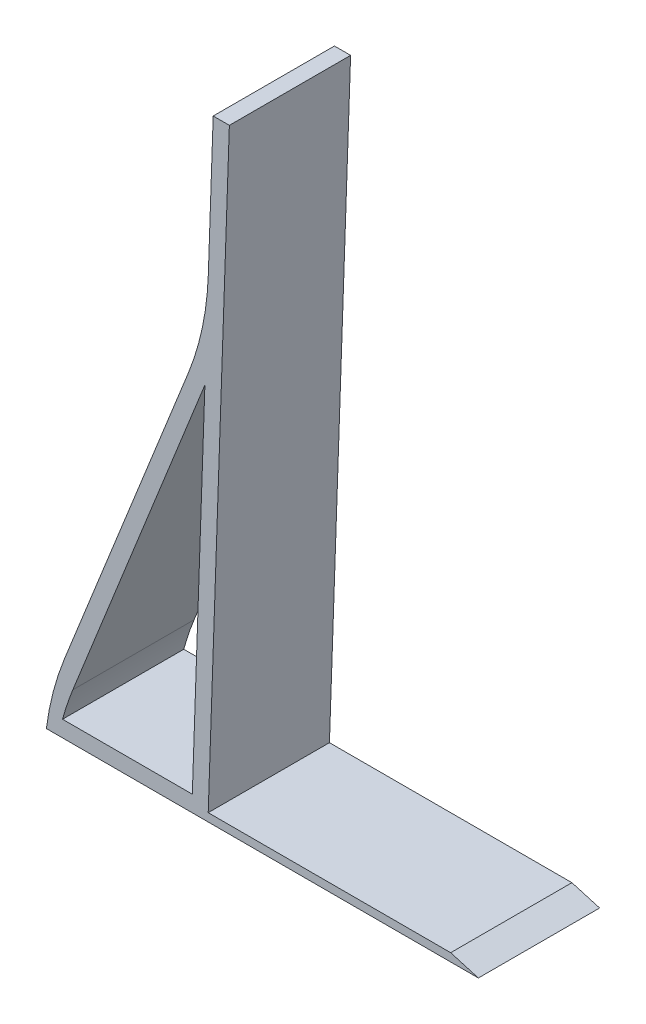
ISO-10303-21;
HEADER;
FILE_DESCRIPTION(('STEP AP214'),'2;1');
FILE_NAME('part.step','',(''),(''),'','','');
FILE_SCHEMA(('AUTOMOTIVE_DESIGN { 1 0 10303 214 1 1 1 1 }'));
ENDSEC;
DATA;
#1=APPLICATION_CONTEXT('core data for automotive mechanical design processes');
#2=APPLICATION_PROTOCOL_DEFINITION('international standard','automotive_design',2000,#1);
#3=PRODUCT_CONTEXT('',#1,'mechanical');
#4=PRODUCT('Part','Part','',(#3));
#5=PRODUCT_RELATED_PRODUCT_CATEGORY('part','',(#4));
#6=PRODUCT_DEFINITION_FORMATION('','',#4);
#7=PRODUCT_DEFINITION_CONTEXT('part definition',#1,'design');
#8=PRODUCT_DEFINITION('design','',#6,#7);
#9=PRODUCT_DEFINITION_SHAPE('','',#8);
#10=(LENGTH_UNIT() NAMED_UNIT(*) SI_UNIT(.MILLI.,.METRE.));
#11=(NAMED_UNIT(*) PLANE_ANGLE_UNIT() SI_UNIT($,.RADIAN.));
#12=(NAMED_UNIT(*) SI_UNIT($,.STERADIAN.) SOLID_ANGLE_UNIT());
#13=UNCERTAINTY_MEASURE_WITH_UNIT(LENGTH_MEASURE(1.E-05),#10,'distance_accuracy_value','');
#14=(GEOMETRIC_REPRESENTATION_CONTEXT(3) GLOBAL_UNCERTAINTY_ASSIGNED_CONTEXT((#13)) GLOBAL_UNIT_ASSIGNED_CONTEXT((#10,
#11,#12)) REPRESENTATION_CONTEXT('',''));
#15=CARTESIAN_POINT('',(0.,0.,0.));
#16=DIRECTION('',(0.,0.,1.));
#17=DIRECTION('',(1.,0.,0.));
#18=AXIS2_PLACEMENT_3D('',#15,#16,#17);
#19=CARTESIAN_POINT('',(0.,0.,30.));
#20=DIRECTION('',(0.,0.,-1.));
#21=DIRECTION('',(-1.,0.,0.));
#22=AXIS2_PLACEMENT_3D('',#19,#20,#21);
#23=PLANE('',#22);
#24=DIRECTION('',(-0.37159028670328,-0.928396821853551,0.));
#25=VECTOR('',#24,1.);
#26=CARTESIAN_POINT('',(-35.,6.,30.));
#27=LINE('',#26,#25);
#28=CARTESIAN_POINT('',(0.0964167144230296,93.6863656076578,30.));
#29=VERTEX_POINT('',#28);
#30=CARTESIAN_POINT('',(-30.5573624072212,17.0996728638293,30.));
#31=VERTEX_POINT('',#30);
#32=EDGE_CURVE('E188',#29,#31,#27,.T.);
#33=ORIENTED_EDGE('',*,*,#32,.T.);
#34=CARTESIAN_POINT('',(34.4304151225274,-8.91164720540033,30.));
#35=DIRECTION('',(0.,0.,-1.));
#36=DIRECTION('',(-1.,0.,0.));
#37=AXIS2_PLACEMENT_3D('',#34,#35,#36);
#38=CIRCLE('',#37,70.);
#39=CARTESIAN_POINT('',(-35.,0.,30.));
#40=VERTEX_POINT('',#39);
#41=EDGE_CURVE('E157',#31,#40,#38,.F.);
#42=ORIENTED_EDGE('',*,*,#41,.T.);
#43=DIRECTION('',(1.,0.,0.));
#44=VECTOR('',#43,1.);
#45=CARTESIAN_POINT('',(-35.,0.,30.));
#46=LINE('',#45,#44);
#47=CARTESIAN_POINT('',(71.8935817968915,0.,30.));
#48=VERTEX_POINT('',#47);
#49=EDGE_CURVE('E192',#40,#48,#46,.T.);
#50=ORIENTED_EDGE('',*,*,#49,.T.);
#51=DIRECTION('',(-0.959947543563525,0.280179788004691,0.));
#52=VECTOR('',#51,1.);
#53=CARTESIAN_POINT('',(71.8935817968915,0.,30.));
#54=LINE('',#53,#52);
#55=CARTESIAN_POINT('',(65.0412135343568,2.,30.));
#56=VERTEX_POINT('',#55);
#57=EDGE_CURVE('E214',#48,#56,#54,.T.);
#58=ORIENTED_EDGE('',*,*,#57,.T.);
#59=DIRECTION('',(-1.,0.,0.));
#60=VECTOR('',#59,1.);
#61=CARTESIAN_POINT('',(65.0412135343568,2.,30.));
#62=LINE('',#61,#60);
#63=CARTESIAN_POINT('',(5.0412135343568,1.99999999999999,30.));
#64=VERTEX_POINT('',#63);
#65=EDGE_CURVE('E212',#56,#64,#62,.T.);
#66=ORIENTED_EDGE('',*,*,#65,.T.);
#67=DIRECTION('',(0.0348994967025044,0.999390827019096,0.));
#68=VECTOR('',#67,1.);
#69=CARTESIAN_POINT('',(5.0412135343568,1.99999999999999,30.));
#70=LINE('',#69,#68);
#71=CARTESIAN_POINT('',(10.2761380397325,151.908624052864,30.));
#72=VERTEX_POINT('',#71);
#73=EDGE_CURVE('E210',#64,#72,#70,.T.);
#74=ORIENTED_EDGE('',*,*,#73,.T.);
#75=DIRECTION('',(-1.,0.,0.));
#76=VECTOR('',#75,1.);
#77=CARTESIAN_POINT('',(10.2761380397325,151.908624052864,30.));
#78=LINE('',#77,#76);
#79=CARTESIAN_POINT('',(6.27613803973246,151.908624052864,30.));
#80=VERTEX_POINT('',#79);
#81=EDGE_CURVE('E208',#72,#80,#78,.T.);
#82=ORIENTED_EDGE('',*,*,#81,.T.);
#83=DIRECTION('',(-0.0348994967025042,-0.999390827019096,0.));
#84=VECTOR('',#83,1.);
#85=CARTESIAN_POINT('',(6.27613803973246,151.908624052864,30.));
#86=LINE('',#85,#84);
#87=CARTESIAN_POINT('',(5.06599707601114,117.254720907712,30.));
#88=VERTEX_POINT('',#87);
#89=EDGE_CURVE('E206',#80,#88,#86,.T.);
#90=ORIENTED_EDGE('',*,*,#89,.T.);
#91=CARTESIAN_POINT('',(-64.8913608153256,119.697685676887,30.));
#92=DIRECTION('',(0.,0.,-1.));
#93=DIRECTION('',(-1.,0.,0.));
#94=AXIS2_PLACEMENT_3D('',#91,#92,#93);
#95=CIRCLE('',#94,70.);
#96=EDGE_CURVE('E11',#88,#29,#95,.T.);
#97=ORIENTED_EDGE('',*,*,#96,.T.);
#98=EDGE_LOOP('',(#33,#42,#50,#58,#66,#74,#82,#90,#97));
#99=FACE_BOUND('',#98,.T.);
#100=DIRECTION('',(1.,0.,0.));
#101=VECTOR('',#100,1.);
#102=CARTESIAN_POINT('',(-31.,4.,30.));
#103=LINE('',#102,#101);
#104=CARTESIAN_POINT('',(-31.,4.,30.));
#105=VERTEX_POINT('',#104);
#106=CARTESIAN_POINT('',(1.10861689614503,4.,30.));
#107=VERTEX_POINT('',#106);
#108=EDGE_CURVE('E133',#105,#107,#103,.T.);
#109=ORIENTED_EDGE('',*,*,#108,.F.);
#110=CARTESIAN_POINT('',(36.530367060477,-14.4295828676951,30.));
#111=DIRECTION('',(0.,0.,-1.));
#112=DIRECTION('',(-1.,0.,0.));
#113=AXIS2_PLACEMENT_3D('',#110,#111,#112);
#114=CIRCLE('',#113,70.);
#115=CARTESIAN_POINT('',(-28.4574104692716,11.5817372015345,30.));
#116=VERTEX_POINT('',#115);
#117=EDGE_CURVE('E145',#105,#116,#114,.T.);
#118=ORIENTED_EDGE('',*,*,#117,.T.);
#119=DIRECTION('',(-0.37159028670328,-0.928396821853551,0.));
#120=VECTOR('',#119,1.);
#121=CARTESIAN_POINT('',(-31.,5.22922443660509,30.));
#122=LINE('',#121,#120);
#123=CARTESIAN_POINT('',(4.22482064495351,93.2363998320419,30.));
#124=VERTEX_POINT('',#123);
#125=EDGE_CURVE('E220',#124,#116,#122,.T.);
#126=ORIENTED_EDGE('',*,*,#125,.F.);
#127=DIRECTION('',(0.0348994967025044,0.999390827019096,0.));
#128=VECTOR('',#127,1.);
#129=CARTESIAN_POINT('',(1.10861689614503,4.,30.));
#130=LINE('',#129,#128);
#131=EDGE_CURVE('E148',#107,#124,#130,.T.);
#132=ORIENTED_EDGE('',*,*,#131,.F.);
#133=EDGE_LOOP('',(#109,#118,#126,#132));
#134=FACE_BOUND('',#133,.T.);
#135=ADVANCED_FACE('F35',(#99,#134),#23,.F.);
#136=CARTESIAN_POINT('',(0.,0.,0.));
#137=DIRECTION('',(0.,0.,-1.));
#138=DIRECTION('',(-1.,0.,0.));
#139=AXIS2_PLACEMENT_3D('',#136,#137,#138);
#140=PLANE('',#139);
#141=DIRECTION('',(1.,0.,0.));
#142=VECTOR('',#141,1.);
#143=CARTESIAN_POINT('',(0.,0.,0.));
#144=LINE('',#143,#142);
#145=CARTESIAN_POINT('',(-35.,0.,0.));
#146=VERTEX_POINT('',#145);
#147=CARTESIAN_POINT('',(71.8935817968915,0.,0.));
#148=VERTEX_POINT('',#147);
#149=EDGE_CURVE('E139',#146,#148,#144,.T.);
#150=ORIENTED_EDGE('',*,*,#149,.F.);
#151=CARTESIAN_POINT('',(34.4304151225274,-8.91164720540033,0.));
#152=DIRECTION('',(0.,0.,-1.));
#153=DIRECTION('',(-1.,0.,0.));
#154=AXIS2_PLACEMENT_3D('',#151,#152,#153);
#155=CIRCLE('',#154,70.);
#156=CARTESIAN_POINT('',(-30.5573624072212,17.0996728638293,0.));
#157=VERTEX_POINT('',#156);
#158=EDGE_CURVE('E161',#146,#157,#155,.T.);
#159=ORIENTED_EDGE('',*,*,#158,.T.);
#160=DIRECTION('',(-0.37159028670328,-0.928396821853551,0.));
#161=VECTOR('',#160,1.);
#162=CARTESIAN_POINT('',(-35.,6.,0.));
#163=LINE('',#162,#161);
#164=CARTESIAN_POINT('',(0.0964167144230296,93.6863656076578,0.));
#165=VERTEX_POINT('',#164);
#166=EDGE_CURVE('E189',#165,#157,#163,.T.);
#167=ORIENTED_EDGE('',*,*,#166,.F.);
#168=CARTESIAN_POINT('',(-64.8913608153256,119.697685676887,0.));
#169=DIRECTION('',(0.,0.,-1.));
#170=DIRECTION('',(-1.,0.,0.));
#171=AXIS2_PLACEMENT_3D('',#168,#169,#170);
#172=CIRCLE('',#171,70.);
#173=CARTESIAN_POINT('',(5.06599707601114,117.254720907712,0.));
#174=VERTEX_POINT('',#173);
#175=EDGE_CURVE('E43',#165,#174,#172,.F.);
#176=ORIENTED_EDGE('',*,*,#175,.T.);
#177=DIRECTION('',(-0.0348994967025042,-0.999390827019096,0.));
#178=VECTOR('',#177,1.);
#179=CARTESIAN_POINT('',(6.27613803973246,151.908624052864,0.));
#180=LINE('',#179,#178);
#181=CARTESIAN_POINT('',(6.27613803973246,151.908624052864,0.));
#182=VERTEX_POINT('',#181);
#183=EDGE_CURVE('E193',#182,#174,#180,.T.);
#184=ORIENTED_EDGE('',*,*,#183,.F.);
#185=DIRECTION('',(-1.,0.,0.));
#186=VECTOR('',#185,1.);
#187=CARTESIAN_POINT('',(10.2761380397325,151.908624052864,0.));
#188=LINE('',#187,#186);
#189=CARTESIAN_POINT('',(10.2761380397325,151.908624052864,0.));
#190=VERTEX_POINT('',#189);
#191=EDGE_CURVE('E195',#190,#182,#188,.T.);
#192=ORIENTED_EDGE('',*,*,#191,.F.);
#193=DIRECTION('',(0.0348994967025044,0.999390827019096,0.));
#194=VECTOR('',#193,1.);
#195=CARTESIAN_POINT('',(5.0412135343568,1.99999999999999,0.));
#196=LINE('',#195,#194);
#197=CARTESIAN_POINT('',(5.0412135343568,1.99999999999999,0.));
#198=VERTEX_POINT('',#197);
#199=EDGE_CURVE('E197',#198,#190,#196,.T.);
#200=ORIENTED_EDGE('',*,*,#199,.F.);
#201=DIRECTION('',(-1.,0.,0.));
#202=VECTOR('',#201,1.);
#203=CARTESIAN_POINT('',(65.0412135343568,2.,0.));
#204=LINE('',#203,#202);
#205=CARTESIAN_POINT('',(65.0412135343568,2.,0.));
#206=VERTEX_POINT('',#205);
#207=EDGE_CURVE('E199',#206,#198,#204,.T.);
#208=ORIENTED_EDGE('',*,*,#207,.F.);
#209=DIRECTION('',(-0.959947543563525,0.280179788004691,0.));
#210=VECTOR('',#209,1.);
#211=CARTESIAN_POINT('',(71.8935817968915,0.,0.));
#212=LINE('',#211,#210);
#213=EDGE_CURVE('E201',#148,#206,#212,.T.);
#214=ORIENTED_EDGE('',*,*,#213,.F.);
#215=EDGE_LOOP('',(#150,#159,#167,#176,#184,#192,#200,#208,#214));
#216=FACE_BOUND('',#215,.T.);
#217=DIRECTION('',(-0.37159028670328,-0.928396821853551,0.));
#218=VECTOR('',#217,1.);
#219=CARTESIAN_POINT('',(-31.,5.22922443660509,0.));
#220=LINE('',#219,#218);
#221=CARTESIAN_POINT('',(4.22482064495351,93.2363998320419,0.));
#222=VERTEX_POINT('',#221);
#223=CARTESIAN_POINT('',(-28.4574104692716,11.5817372015345,0.));
#224=VERTEX_POINT('',#223);
#225=EDGE_CURVE('E149',#222,#224,#220,.T.);
#226=ORIENTED_EDGE('',*,*,#225,.T.);
#227=CARTESIAN_POINT('',(36.530367060477,-14.4295828676951,0.));
#228=DIRECTION('',(0.,0.,-1.));
#229=DIRECTION('',(-1.,0.,0.));
#230=AXIS2_PLACEMENT_3D('',#227,#228,#229);
#231=CIRCLE('',#230,70.);
#232=CARTESIAN_POINT('',(-31.,4.,0.));
#233=VERTEX_POINT('',#232);
#234=EDGE_CURVE('E155',#224,#233,#231,.F.);
#235=ORIENTED_EDGE('',*,*,#234,.T.);
#236=DIRECTION('',(1.,0.,0.));
#237=VECTOR('',#236,1.);
#238=CARTESIAN_POINT('',(0.,4.,0.));
#239=LINE('',#238,#237);
#240=CARTESIAN_POINT('',(1.10861689614503,4.,0.));
#241=VERTEX_POINT('',#240);
#242=EDGE_CURVE('E136',#233,#241,#239,.T.);
#243=ORIENTED_EDGE('',*,*,#242,.T.);
#244=DIRECTION('',(0.0348994967025044,0.999390827019096,0.));
#245=VECTOR('',#244,1.);
#246=CARTESIAN_POINT('',(1.10861689614503,4.,0.));
#247=LINE('',#246,#245);
#248=EDGE_CURVE('E223',#241,#222,#247,.T.);
#249=ORIENTED_EDGE('',*,*,#248,.T.);
#250=EDGE_LOOP('',(#226,#235,#243,#249));
#251=FACE_BOUND('',#250,.T.);
#252=ADVANCED_FACE('F235',(#216,#251),#140,.T.);
#253=CARTESIAN_POINT('',(0.,0.,30.));
#254=DIRECTION('',(0.,1.,0.));
#255=DIRECTION('',(0.,0.,1.));
#256=AXIS2_PLACEMENT_3D('',#253,#254,#255);
#257=PLANE('',#256);
#258=ORIENTED_EDGE('',*,*,#149,.T.);
#259=DIRECTION('',(0.,0.,-1.));
#260=VECTOR('',#259,1.);
#261=CARTESIAN_POINT('',(71.8935817968915,0.,30.));
#262=LINE('',#261,#260);
#263=EDGE_CURVE('E170',#48,#148,#262,.T.);
#264=ORIENTED_EDGE('',*,*,#263,.F.);
#265=ORIENTED_EDGE('',*,*,#49,.F.);
#266=DIRECTION('',(0.,0.,-1.));
#267=VECTOR('',#266,1.);
#268=CARTESIAN_POINT('',(-35.,0.,30.));
#269=LINE('',#268,#267);
#270=EDGE_CURVE('E185',#40,#146,#269,.T.);
#271=ORIENTED_EDGE('',*,*,#270,.T.);
#272=EDGE_LOOP('',(#258,#264,#265,#271));
#273=FACE_BOUND('',#272,.T.);
#274=ADVANCED_FACE('F237',(#273),#257,.F.);
#275=CARTESIAN_POINT('',(71.8935817968915,0.,30.));
#276=DIRECTION('',(-0.280179788004691,-0.959947543563525,0.));
#277=DIRECTION('',(0.959947543563525,-0.280179788004691,0.));
#278=AXIS2_PLACEMENT_3D('',#275,#276,#277);
#279=PLANE('',#278);
#280=ORIENTED_EDGE('',*,*,#213,.T.);
#281=DIRECTION('',(0.,0.,-1.));
#282=VECTOR('',#281,1.);
#283=CARTESIAN_POINT('',(65.0412135343568,2.,30.));
#284=LINE('',#283,#282);
#285=EDGE_CURVE('E173',#56,#206,#284,.T.);
#286=ORIENTED_EDGE('',*,*,#285,.F.);
#287=ORIENTED_EDGE('',*,*,#57,.F.);
#288=ORIENTED_EDGE('',*,*,#263,.T.);
#289=EDGE_LOOP('',(#280,#286,#287,#288));
#290=FACE_BOUND('',#289,.T.);
#291=ADVANCED_FACE('F243',(#290),#279,.F.);
#292=CARTESIAN_POINT('',(65.0412135343568,2.,30.));
#293=DIRECTION('',(0.,-1.,0.));
#294=DIRECTION('',(1.,0.,0.));
#295=AXIS2_PLACEMENT_3D('',#292,#293,#294);
#296=PLANE('',#295);
#297=ORIENTED_EDGE('',*,*,#207,.T.);
#298=DIRECTION('',(0.,0.,-1.));
#299=VECTOR('',#298,1.);
#300=CARTESIAN_POINT('',(5.0412135343568,1.99999999999999,30.));
#301=LINE('',#300,#299);
#302=EDGE_CURVE('E176',#64,#198,#301,.T.);
#303=ORIENTED_EDGE('',*,*,#302,.F.);
#304=ORIENTED_EDGE('',*,*,#65,.F.);
#305=ORIENTED_EDGE('',*,*,#285,.T.);
#306=EDGE_LOOP('',(#297,#303,#304,#305));
#307=FACE_BOUND('',#306,.T.);
#308=ADVANCED_FACE('F265',(#307),#296,.F.);
#309=CARTESIAN_POINT('',(5.0412135343568,1.99999999999999,30.));
#310=DIRECTION('',(-0.999390827019096,0.0348994967025044,0.));
#311=DIRECTION('',(-0.0348994967025044,-0.999390827019096,0.));
#312=AXIS2_PLACEMENT_3D('',#309,#310,#311);
#313=PLANE('',#312);
#314=ORIENTED_EDGE('',*,*,#199,.T.);
#315=DIRECTION('',(0.,0.,-1.));
#316=VECTOR('',#315,1.);
#317=CARTESIAN_POINT('',(10.2761380397325,151.908624052864,30.));
#318=LINE('',#317,#316);
#319=EDGE_CURVE('E179',#72,#190,#318,.T.);
#320=ORIENTED_EDGE('',*,*,#319,.F.);
#321=ORIENTED_EDGE('',*,*,#73,.F.);
#322=ORIENTED_EDGE('',*,*,#302,.T.);
#323=EDGE_LOOP('',(#314,#320,#321,#322));
#324=FACE_BOUND('',#323,.T.);
#325=ADVANCED_FACE('F261',(#324),#313,.F.);
#326=CARTESIAN_POINT('',(10.2761380397325,151.908624052864,30.));
#327=DIRECTION('',(0.,-1.,0.));
#328=DIRECTION('',(1.,0.,0.));
#329=AXIS2_PLACEMENT_3D('',#326,#327,#328);
#330=PLANE('',#329);
#331=ORIENTED_EDGE('',*,*,#191,.T.);
#332=DIRECTION('',(0.,0.,-1.));
#333=VECTOR('',#332,1.);
#334=CARTESIAN_POINT('',(6.27613803973246,151.908624052864,30.));
#335=LINE('',#334,#333);
#336=EDGE_CURVE('E182',#80,#182,#335,.T.);
#337=ORIENTED_EDGE('',*,*,#336,.F.);
#338=ORIENTED_EDGE('',*,*,#81,.F.);
#339=ORIENTED_EDGE('',*,*,#319,.T.);
#340=EDGE_LOOP('',(#331,#337,#338,#339));
#341=FACE_BOUND('',#340,.T.);
#342=ADVANCED_FACE('F258',(#341),#330,.F.);
#343=CARTESIAN_POINT('',(6.27613803973246,151.908624052864,30.));
#344=DIRECTION('',(0.999390827019096,-0.0348994967025042,0.));
#345=DIRECTION('',(0.0348994967025042,0.999390827019096,0.));
#346=AXIS2_PLACEMENT_3D('',#343,#344,#345);
#347=PLANE('',#346);
#348=ORIENTED_EDGE('',*,*,#183,.T.);
#349=DIRECTION('',(0.,0.,-1.));
#350=VECTOR('',#349,1.);
#351=CARTESIAN_POINT('',(5.06599707601114,117.254720907712,30.));
#352=LINE('',#351,#350);
#353=EDGE_CURVE('E50',#174,#88,#352,.F.);
#354=ORIENTED_EDGE('',*,*,#353,.T.);
#355=ORIENTED_EDGE('',*,*,#89,.F.);
#356=ORIENTED_EDGE('',*,*,#336,.T.);
#357=EDGE_LOOP('',(#348,#354,#355,#356));
#358=FACE_BOUND('',#357,.T.);
#359=ADVANCED_FACE('F254',(#358),#347,.F.);
#360=CARTESIAN_POINT('',(-35.,6.,30.));
#361=DIRECTION('',(0.928396821853551,-0.37159028670328,0.));
#362=DIRECTION('',(0.37159028670328,0.928396821853551,0.));
#363=AXIS2_PLACEMENT_3D('',#360,#361,#362);
#364=PLANE('',#363);
#365=ORIENTED_EDGE('',*,*,#32,.F.);
#366=DIRECTION('',(0.,0.,-1.));
#367=VECTOR('',#366,1.);
#368=CARTESIAN_POINT('',(0.0964167144230504,93.6863656076578,0.));
#369=LINE('',#368,#367);
#370=EDGE_CURVE('E164',#29,#165,#369,.T.);
#371=ORIENTED_EDGE('',*,*,#370,.T.);
#372=ORIENTED_EDGE('',*,*,#166,.T.);
#373=DIRECTION('',(0.,0.,1.));
#374=VECTOR('',#373,1.);
#375=CARTESIAN_POINT('',(-30.5573624072212,17.0996728638293,30.));
#376=LINE('',#375,#374);
#377=EDGE_CURVE('E167',#157,#31,#376,.T.);
#378=ORIENTED_EDGE('',*,*,#377,.T.);
#379=EDGE_LOOP('',(#365,#371,#372,#378));
#380=FACE_BOUND('',#379,.T.);
#381=ADVANCED_FACE('F251',(#380),#364,.F.);
#382=CARTESIAN_POINT('',(0.,4.,30.));
#383=DIRECTION('',(0.,1.,0.));
#384=DIRECTION('',(0.,0.,1.));
#385=AXIS2_PLACEMENT_3D('',#382,#383,#384);
#386=PLANE('',#385);
#387=ORIENTED_EDGE('',*,*,#242,.F.);
#388=DIRECTION('',(0.,0.,-1.));
#389=VECTOR('',#388,1.);
#390=CARTESIAN_POINT('',(-31.,4.,30.));
#391=LINE('',#390,#389);
#392=EDGE_CURVE('E130',#105,#233,#391,.T.);
#393=ORIENTED_EDGE('',*,*,#392,.F.);
#394=ORIENTED_EDGE('',*,*,#108,.T.);
#395=DIRECTION('',(0.,0.,-1.));
#396=VECTOR('',#395,1.);
#397=CARTESIAN_POINT('',(1.10861689614503,4.,30.));
#398=LINE('',#397,#396);
#399=EDGE_CURVE('E140',#107,#241,#398,.T.);
#400=ORIENTED_EDGE('',*,*,#399,.T.);
#401=EDGE_LOOP('',(#387,#393,#394,#400));
#402=FACE_BOUND('',#401,.T.);
#403=ADVANCED_FACE('F132',(#402),#386,.T.);
#404=CARTESIAN_POINT('',(1.10861689614503,4.,30.));
#405=DIRECTION('',(-0.999390827019096,0.0348994967025044,0.));
#406=DIRECTION('',(-0.0348994967025044,-0.999390827019096,0.));
#407=AXIS2_PLACEMENT_3D('',#404,#405,#406);
#408=PLANE('',#407);
#409=ORIENTED_EDGE('',*,*,#248,.F.);
#410=ORIENTED_EDGE('',*,*,#399,.F.);
#411=ORIENTED_EDGE('',*,*,#131,.T.);
#412=DIRECTION('',(0.,0.,-1.));
#413=VECTOR('',#412,1.);
#414=CARTESIAN_POINT('',(4.22482064495351,93.2363998320419,30.));
#415=LINE('',#414,#413);
#416=EDGE_CURVE('E218',#124,#222,#415,.T.);
#417=ORIENTED_EDGE('',*,*,#416,.T.);
#418=EDGE_LOOP('',(#409,#410,#411,#417));
#419=FACE_BOUND('',#418,.T.);
#420=ADVANCED_FACE('F230',(#419),#408,.T.);
#421=CARTESIAN_POINT('',(-31.,5.22922443660509,30.));
#422=DIRECTION('',(0.928396821853551,-0.37159028670328,0.));
#423=DIRECTION('',(0.37159028670328,0.928396821853551,0.));
#424=AXIS2_PLACEMENT_3D('',#421,#422,#423);
#425=PLANE('',#424);
#426=ORIENTED_EDGE('',*,*,#125,.T.);
#427=DIRECTION('',(0.,0.,-1.));
#428=VECTOR('',#427,1.);
#429=CARTESIAN_POINT('',(-28.4574104692716,11.5817372015345,0.));
#430=LINE('',#429,#428);
#431=EDGE_CURVE('E154',#116,#224,#430,.T.);
#432=ORIENTED_EDGE('',*,*,#431,.T.);
#433=ORIENTED_EDGE('',*,*,#225,.F.);
#434=ORIENTED_EDGE('',*,*,#416,.F.);
#435=EDGE_LOOP('',(#426,#432,#433,#434));
#436=FACE_BOUND('',#435,.T.);
#437=ADVANCED_FACE('F233',(#436),#425,.T.);
#438=CARTESIAN_POINT('',(36.530367060477,-14.4295828676951,30.));
#439=DIRECTION('',(0.,0.,1.));
#440=DIRECTION('',(1.,0.,0.));
#441=AXIS2_PLACEMENT_3D('',#438,#439,#440);
#442=CYLINDRICAL_SURFACE('',#441,70.);
#443=ORIENTED_EDGE('',*,*,#117,.F.);
#444=ORIENTED_EDGE('',*,*,#392,.T.);
#445=ORIENTED_EDGE('',*,*,#234,.F.);
#446=ORIENTED_EDGE('',*,*,#431,.F.);
#447=EDGE_LOOP('',(#443,#444,#445,#446));
#448=FACE_BOUND('',#447,.T.);
#449=ADVANCED_FACE('F152',(#448),#442,.F.);
#450=CARTESIAN_POINT('',(-64.8913608153256,119.697685676887,30.));
#451=DIRECTION('',(0.,0.,1.));
#452=DIRECTION('',(1.,0.,0.));
#453=AXIS2_PLACEMENT_3D('',#450,#451,#452);
#454=CYLINDRICAL_SURFACE('',#453,70.);
#455=ORIENTED_EDGE('',*,*,#96,.F.);
#456=ORIENTED_EDGE('',*,*,#353,.F.);
#457=ORIENTED_EDGE('',*,*,#175,.F.);
#458=ORIENTED_EDGE('',*,*,#370,.F.);
#459=EDGE_LOOP('',(#455,#456,#457,#458));
#460=FACE_BOUND('',#459,.T.);
#461=ADVANCED_FACE('F274',(#460),#454,.F.);
#462=CARTESIAN_POINT('',(34.4304151225274,-8.91164720540033,30.));
#463=DIRECTION('',(0.,0.,1.));
#464=DIRECTION('',(1.,0.,0.));
#465=AXIS2_PLACEMENT_3D('',#462,#463,#464);
#466=CYLINDRICAL_SURFACE('',#465,70.);
#467=ORIENTED_EDGE('',*,*,#41,.F.);
#468=ORIENTED_EDGE('',*,*,#377,.F.);
#469=ORIENTED_EDGE('',*,*,#158,.F.);
#470=ORIENTED_EDGE('',*,*,#270,.F.);
#471=EDGE_LOOP('',(#467,#468,#469,#470));
#472=FACE_BOUND('',#471,.T.);
#473=ADVANCED_FACE('F37',(#472),#466,.T.);
#474=CLOSED_SHELL('',(#135,#252,#274,#291,#308,#325,#342,#359,#381,#403,#420,#437,#449,#461,#473));
#475=MANIFOLD_SOLID_BREP('B2',#474);
#476=ADVANCED_BREP_SHAPE_REPRESENTATION('',(#18,#475),#14);
#477=SHAPE_DEFINITION_REPRESENTATION(#9,#476);
ENDSEC;
END-ISO-10303-21;
